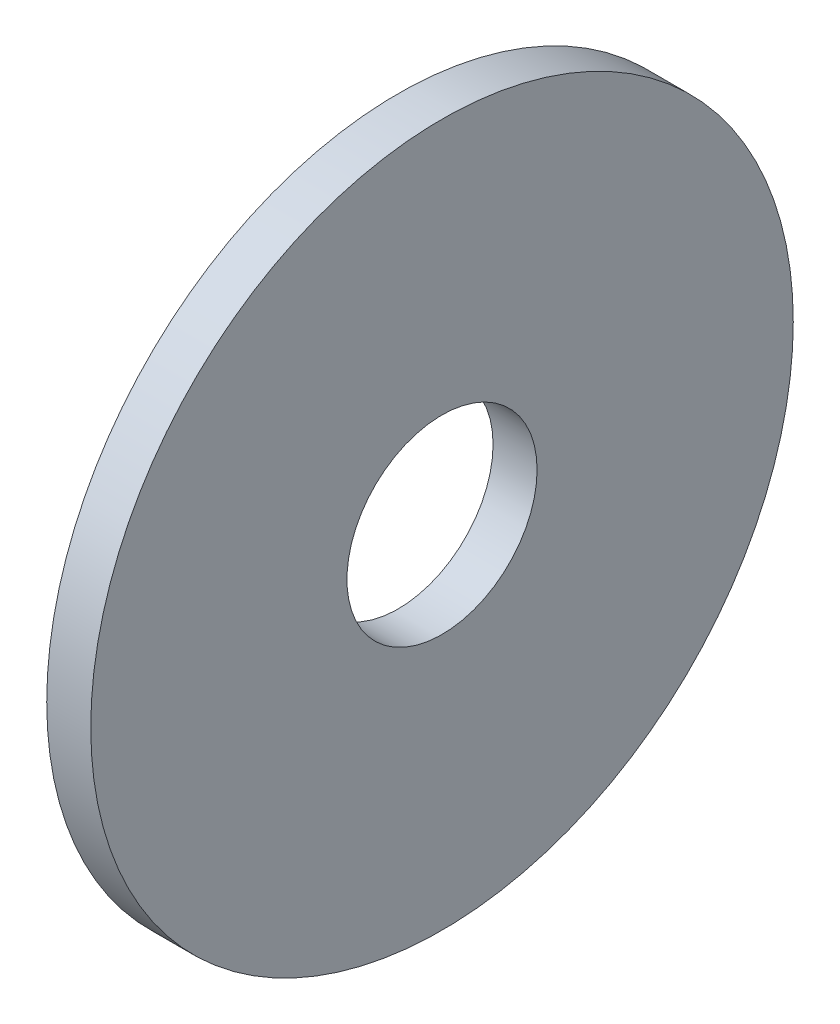
ISO-10303-21;
HEADER;
FILE_DESCRIPTION(('STEP AP214'),'2;1');
FILE_NAME('part.step','',(''),(''),'','','');
FILE_SCHEMA(('AUTOMOTIVE_DESIGN { 1 0 10303 214 1 1 1 1 }'));
ENDSEC;
DATA;
#1=APPLICATION_CONTEXT('core data for automotive mechanical design processes');
#2=APPLICATION_PROTOCOL_DEFINITION('international standard','automotive_design',2000,#1);
#3=PRODUCT_CONTEXT('',#1,'mechanical');
#4=PRODUCT('Part','Part','',(#3));
#5=PRODUCT_RELATED_PRODUCT_CATEGORY('part','',(#4));
#6=PRODUCT_DEFINITION_FORMATION('','',#4);
#7=PRODUCT_DEFINITION_CONTEXT('part definition',#1,'design');
#8=PRODUCT_DEFINITION('design','',#6,#7);
#9=PRODUCT_DEFINITION_SHAPE('','',#8);
#10=(LENGTH_UNIT() NAMED_UNIT(*) SI_UNIT(.MILLI.,.METRE.));
#11=(NAMED_UNIT(*) PLANE_ANGLE_UNIT() SI_UNIT($,.RADIAN.));
#12=(NAMED_UNIT(*) SI_UNIT($,.STERADIAN.) SOLID_ANGLE_UNIT());
#13=UNCERTAINTY_MEASURE_WITH_UNIT(LENGTH_MEASURE(1.E-05),#10,'distance_accuracy_value','');
#14=(GEOMETRIC_REPRESENTATION_CONTEXT(3) GLOBAL_UNCERTAINTY_ASSIGNED_CONTEXT((#13)) GLOBAL_UNIT_ASSIGNED_CONTEXT((#10,
#11,#12)) REPRESENTATION_CONTEXT('',''));
#15=CARTESIAN_POINT('',(0.,0.,0.));
#16=DIRECTION('',(0.,0.,1.));
#17=DIRECTION('',(1.,0.,0.));
#18=AXIS2_PLACEMENT_3D('',#15,#16,#17);
#19=CARTESIAN_POINT('',(0.,0.,0.));
#20=DIRECTION('',(1.,0.,0.));
#21=DIRECTION('',(0.,1.,0.));
#22=AXIS2_PLACEMENT_3D('',#19,#20,#21);
#23=PLANE('',#22);
#24=CARTESIAN_POINT('',(0.,0.,0.));
#25=DIRECTION('',(1.,0.,0.));
#26=DIRECTION('',(0.,0.,-1.));
#27=AXIS2_PLACEMENT_3D('',#24,#25,#26);
#28=CIRCLE('',#27,2.5781);
#29=CARTESIAN_POINT('',(0.,0.,-2.5781));
#30=VERTEX_POINT('',#29);
#31=EDGE_CURVE('E57',#30,#30,#28,.T.);
#32=ORIENTED_EDGE('',*,*,#31,.T.);
#33=EDGE_LOOP('',(#32));
#34=FACE_BOUND('',#33,.T.);
#35=CARTESIAN_POINT('',(0.,0.,0.));
#36=DIRECTION('',(1.,0.,0.));
#37=DIRECTION('',(0.,0.,-1.));
#38=AXIS2_PLACEMENT_3D('',#35,#36,#37);
#39=CIRCLE('',#38,9.525);
#40=CARTESIAN_POINT('',(0.,0.,-9.525));
#41=VERTEX_POINT('',#40);
#42=EDGE_CURVE('E65',#41,#41,#39,.T.);
#43=ORIENTED_EDGE('',*,*,#42,.F.);
#44=EDGE_LOOP('',(#43));
#45=FACE_BOUND('',#44,.T.);
#46=ADVANCED_FACE('F17',(#34,#45),#23,.F.);
#47=CARTESIAN_POINT('',(1.1938,0.,0.));
#48=DIRECTION('',(1.,0.,0.));
#49=DIRECTION('',(0.,1.,0.));
#50=AXIS2_PLACEMENT_3D('',#47,#48,#49);
#51=PLANE('',#50);
#52=CARTESIAN_POINT('',(1.1938,0.,0.));
#53=DIRECTION('',(1.,0.,0.));
#54=DIRECTION('',(0.,0.,-1.));
#55=AXIS2_PLACEMENT_3D('',#52,#53,#54);
#56=CIRCLE('',#55,2.5781);
#57=CARTESIAN_POINT('',(1.1938,0.,-2.5781));
#58=VERTEX_POINT('',#57);
#59=EDGE_CURVE('E56',#58,#58,#56,.T.);
#60=ORIENTED_EDGE('',*,*,#59,.F.);
#61=EDGE_LOOP('',(#60));
#62=FACE_BOUND('',#61,.T.);
#63=CARTESIAN_POINT('',(1.1938,0.,0.));
#64=DIRECTION('',(1.,0.,0.));
#65=DIRECTION('',(0.,0.,-1.));
#66=AXIS2_PLACEMENT_3D('',#63,#64,#65);
#67=CIRCLE('',#66,9.525);
#68=CARTESIAN_POINT('',(1.1938,0.,-9.525));
#69=VERTEX_POINT('',#68);
#70=EDGE_CURVE('E11',#69,#69,#67,.T.);
#71=ORIENTED_EDGE('',*,*,#70,.T.);
#72=EDGE_LOOP('',(#71));
#73=FACE_BOUND('',#72,.T.);
#74=ADVANCED_FACE('F77',(#62,#73),#51,.T.);
#75=CARTESIAN_POINT('',(1.1938,0.,0.));
#76=DIRECTION('',(-1.,0.,0.));
#77=DIRECTION('',(0.,0.,1.));
#78=AXIS2_PLACEMENT_3D('',#75,#76,#77);
#79=CYLINDRICAL_SURFACE('',#78,9.525);
#80=ORIENTED_EDGE('',*,*,#42,.T.);
#81=DIRECTION('',(1.,0.,0.));
#82=VECTOR('',#81,1.);
#83=CARTESIAN_POINT('',(1.1938,0.,-9.525));
#84=LINE('',#83,#82);
#85=EDGE_CURVE('E25',#41,#69,#84,.T.);
#86=ORIENTED_EDGE('',*,*,#85,.T.);
#87=ORIENTED_EDGE('',*,*,#70,.F.);
#88=ORIENTED_EDGE('',*,*,#85,.F.);
#89=EDGE_LOOP('',(#80,#86,#87,#88));
#90=FACE_BOUND('',#89,.T.);
#91=ADVANCED_FACE('F73',(#90),#79,.T.);
#92=CARTESIAN_POINT('',(1.1938,0.,0.));
#93=DIRECTION('',(-1.,0.,0.));
#94=DIRECTION('',(0.,0.,1.));
#95=AXIS2_PLACEMENT_3D('',#92,#93,#94);
#96=CYLINDRICAL_SURFACE('',#95,2.5781);
#97=ORIENTED_EDGE('',*,*,#59,.T.);
#98=DIRECTION('',(-1.,0.,0.));
#99=VECTOR('',#98,1.);
#100=CARTESIAN_POINT('',(1.1938,0.,-2.5781));
#101=LINE('',#100,#99);
#102=EDGE_CURVE('E53',#58,#30,#101,.T.);
#103=ORIENTED_EDGE('',*,*,#102,.T.);
#104=ORIENTED_EDGE('',*,*,#31,.F.);
#105=ORIENTED_EDGE('',*,*,#102,.F.);
#106=EDGE_LOOP('',(#97,#103,#104,#105));
#107=FACE_BOUND('',#106,.T.);
#108=ADVANCED_FACE('F54',(#107),#96,.F.);
#109=CLOSED_SHELL('',(#46,#74,#91,#108));
#110=MANIFOLD_SOLID_BREP('B1',#109);
#111=ADVANCED_BREP_SHAPE_REPRESENTATION('',(#18,#110),#14);
#112=SHAPE_DEFINITION_REPRESENTATION(#9,#111);
ENDSEC;
END-ISO-10303-21;
